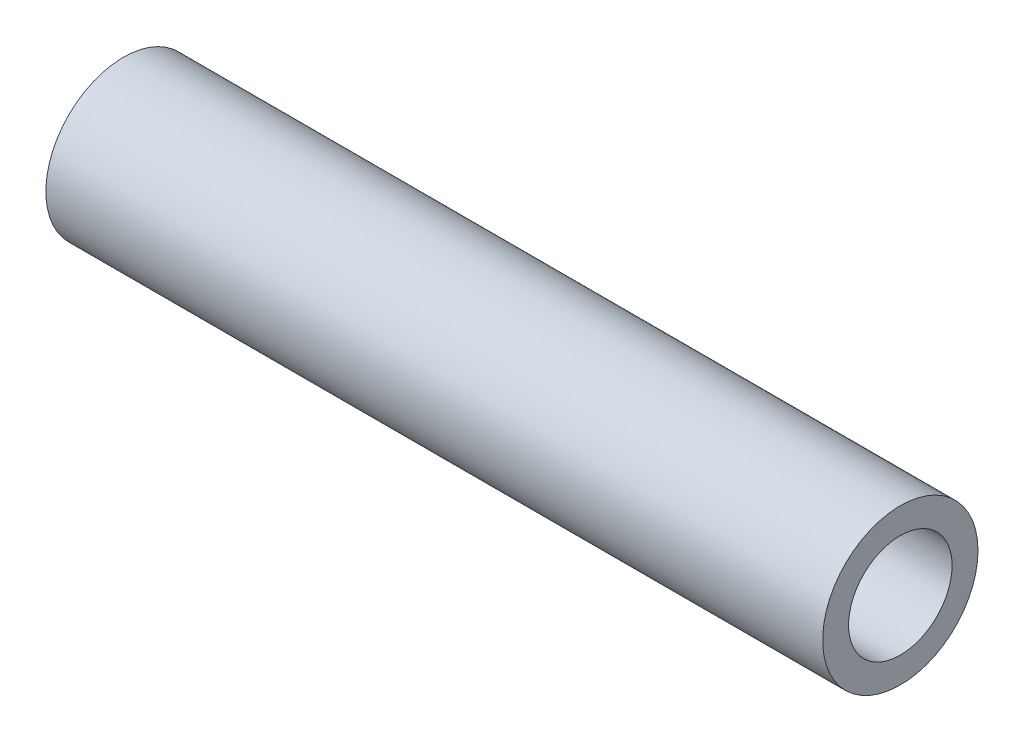
ISO-10303-21;
HEADER;
FILE_DESCRIPTION(('STEP AP214'),'2;1');
FILE_NAME('part.step','',(''),(''),'','','');
FILE_SCHEMA(('AUTOMOTIVE_DESIGN { 1 0 10303 214 1 1 1 1 }'));
ENDSEC;
DATA;
#1=APPLICATION_CONTEXT('core data for automotive mechanical design processes');
#2=APPLICATION_PROTOCOL_DEFINITION('international standard','automotive_design',2000,#1);
#3=PRODUCT_CONTEXT('',#1,'mechanical');
#4=PRODUCT('Part','Part','',(#3));
#5=PRODUCT_RELATED_PRODUCT_CATEGORY('part','',(#4));
#6=PRODUCT_DEFINITION_FORMATION('','',#4);
#7=PRODUCT_DEFINITION_CONTEXT('part definition',#1,'design');
#8=PRODUCT_DEFINITION('design','',#6,#7);
#9=PRODUCT_DEFINITION_SHAPE('','',#8);
#10=(LENGTH_UNIT() NAMED_UNIT(*) SI_UNIT(.MILLI.,.METRE.));
#11=(NAMED_UNIT(*) PLANE_ANGLE_UNIT() SI_UNIT($,.RADIAN.));
#12=(NAMED_UNIT(*) SI_UNIT($,.STERADIAN.) SOLID_ANGLE_UNIT());
#13=UNCERTAINTY_MEASURE_WITH_UNIT(LENGTH_MEASURE(1.E-05),#10,'distance_accuracy_value','');
#14=(GEOMETRIC_REPRESENTATION_CONTEXT(3) GLOBAL_UNCERTAINTY_ASSIGNED_CONTEXT((#13)) GLOBAL_UNIT_ASSIGNED_CONTEXT((#10,
#11,#12)) REPRESENTATION_CONTEXT('',''));
#15=CARTESIAN_POINT('',(0.,0.,0.));
#16=DIRECTION('',(0.,0.,1.));
#17=DIRECTION('',(1.,0.,0.));
#18=AXIS2_PLACEMENT_3D('',#15,#16,#17);
#19=CARTESIAN_POINT('',(300.,0.,0.));
#20=DIRECTION('',(-1.,0.,0.));
#21=DIRECTION('',(0.,0.,1.));
#22=AXIS2_PLACEMENT_3D('',#19,#20,#21);
#23=CYLINDRICAL_SURFACE('',#22,30.);
#24=CARTESIAN_POINT('',(300.,0.,0.));
#25=DIRECTION('',(1.,0.,0.));
#26=DIRECTION('',(0.,0.,-1.));
#27=AXIS2_PLACEMENT_3D('',#24,#25,#26);
#28=CIRCLE('',#27,30.);
#29=CARTESIAN_POINT('',(300.,0.,-30.));
#30=VERTEX_POINT('',#29);
#31=EDGE_CURVE('E10',#30,#30,#28,.T.);
#32=ORIENTED_EDGE('',*,*,#31,.F.);
#33=EDGE_LOOP('',(#32));
#34=FACE_BOUND('',#33,.T.);
#35=CARTESIAN_POINT('',(0.,0.,0.));
#36=DIRECTION('',(1.,0.,0.));
#37=DIRECTION('',(0.,0.,-1.));
#38=AXIS2_PLACEMENT_3D('',#35,#36,#37);
#39=CIRCLE('',#38,30.);
#40=CARTESIAN_POINT('',(0.,0.,-30.));
#41=VERTEX_POINT('',#40);
#42=EDGE_CURVE('E35',#41,#41,#39,.T.);
#43=ORIENTED_EDGE('',*,*,#42,.T.);
#44=EDGE_LOOP('',(#43));
#45=FACE_BOUND('',#44,.T.);
#46=ADVANCED_FACE('F32',(#34,#45),#23,.T.);
#47=CARTESIAN_POINT('',(300.,0.,0.));
#48=DIRECTION('',(1.,0.,0.));
#49=DIRECTION('',(0.,0.,-1.));
#50=AXIS2_PLACEMENT_3D('',#47,#48,#49);
#51=PLANE('',#50);
#52=CARTESIAN_POINT('',(300.,0.,0.));
#53=DIRECTION('',(1.,0.,0.));
#54=DIRECTION('',(0.,0.,-1.));
#55=AXIS2_PLACEMENT_3D('',#52,#53,#54);
#56=CIRCLE('',#55,20.);
#57=CARTESIAN_POINT('',(300.,0.,-20.));
#58=VERTEX_POINT('',#57);
#59=EDGE_CURVE('E44',#58,#58,#56,.T.);
#60=ORIENTED_EDGE('',*,*,#59,.F.);
#61=EDGE_LOOP('',(#60));
#62=FACE_BOUND('',#61,.T.);
#63=ORIENTED_EDGE('',*,*,#31,.T.);
#64=EDGE_LOOP('',(#63));
#65=FACE_BOUND('',#64,.T.);
#66=ADVANCED_FACE('F59',(#62,#65),#51,.T.);
#67=CARTESIAN_POINT('',(0.,0.,0.));
#68=DIRECTION('',(1.,0.,0.));
#69=DIRECTION('',(0.,0.,-1.));
#70=AXIS2_PLACEMENT_3D('',#67,#68,#69);
#71=PLANE('',#70);
#72=CARTESIAN_POINT('',(0.,0.,0.));
#73=DIRECTION('',(1.,0.,0.));
#74=DIRECTION('',(0.,0.,-1.));
#75=AXIS2_PLACEMENT_3D('',#72,#73,#74);
#76=CIRCLE('',#75,20.);
#77=CARTESIAN_POINT('',(0.,0.,-20.));
#78=VERTEX_POINT('',#77);
#79=EDGE_CURVE('E42',#78,#78,#76,.T.);
#80=ORIENTED_EDGE('',*,*,#79,.T.);
#81=EDGE_LOOP('',(#80));
#82=FACE_BOUND('',#81,.T.);
#83=ORIENTED_EDGE('',*,*,#42,.F.);
#84=EDGE_LOOP('',(#83));
#85=FACE_BOUND('',#84,.T.);
#86=ADVANCED_FACE('F50',(#82,#85),#71,.F.);
#87=CARTESIAN_POINT('',(0.,0.,0.));
#88=DIRECTION('',(1.,0.,0.));
#89=DIRECTION('',(0.,0.,-1.));
#90=AXIS2_PLACEMENT_3D('',#87,#88,#89);
#91=CYLINDRICAL_SURFACE('',#90,20.);
#92=ORIENTED_EDGE('',*,*,#79,.F.);
#93=EDGE_LOOP('',(#92));
#94=FACE_BOUND('',#93,.T.);
#95=ORIENTED_EDGE('',*,*,#59,.T.);
#96=EDGE_LOOP('',(#95));
#97=FACE_BOUND('',#96,.T.);
#98=ADVANCED_FACE('F53',(#94,#97),#91,.F.);
#99=CLOSED_SHELL('',(#46,#66,#86,#98));
#100=MANIFOLD_SOLID_BREP('B2',#99);
#101=ADVANCED_BREP_SHAPE_REPRESENTATION('',(#18,#100),#14);
#102=SHAPE_DEFINITION_REPRESENTATION(#9,#101);
ENDSEC;
END-ISO-10303-21;
